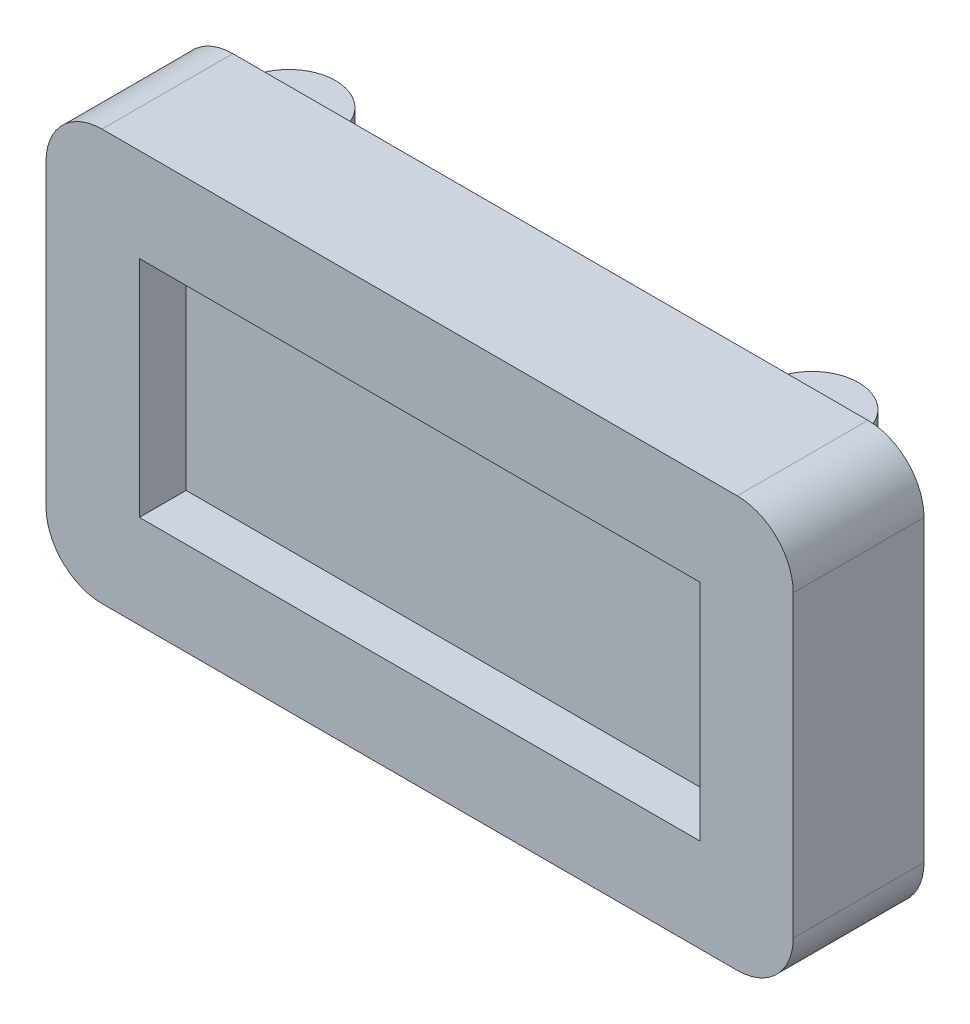
ISO-10303-21;
HEADER;
FILE_DESCRIPTION(('STEP AP214'),'2;1');
FILE_NAME('part.step','',(''),(''),'','','');
FILE_SCHEMA(('AUTOMOTIVE_DESIGN { 1 0 10303 214 1 1 1 1 }'));
ENDSEC;
DATA;
#1=APPLICATION_CONTEXT('core data for automotive mechanical design processes');
#2=APPLICATION_PROTOCOL_DEFINITION('international standard','automotive_design',2000,#1);
#3=PRODUCT_CONTEXT('',#1,'mechanical');
#4=PRODUCT('Part','Part','',(#3));
#5=PRODUCT_RELATED_PRODUCT_CATEGORY('part','',(#4));
#6=PRODUCT_DEFINITION_FORMATION('','',#4);
#7=PRODUCT_DEFINITION_CONTEXT('part definition',#1,'design');
#8=PRODUCT_DEFINITION('design','',#6,#7);
#9=PRODUCT_DEFINITION_SHAPE('','',#8);
#10=(LENGTH_UNIT() NAMED_UNIT(*) SI_UNIT(.MILLI.,.METRE.));
#11=(NAMED_UNIT(*) PLANE_ANGLE_UNIT() SI_UNIT($,.RADIAN.));
#12=(NAMED_UNIT(*) SI_UNIT($,.STERADIAN.) SOLID_ANGLE_UNIT());
#13=UNCERTAINTY_MEASURE_WITH_UNIT(LENGTH_MEASURE(1.E-05),#10,'distance_accuracy_value','');
#14=(GEOMETRIC_REPRESENTATION_CONTEXT(3) GLOBAL_UNCERTAINTY_ASSIGNED_CONTEXT((#13)) GLOBAL_UNIT_ASSIGNED_CONTEXT((#10,
#11,#12)) REPRESENTATION_CONTEXT('',''));
#15=CARTESIAN_POINT('',(0.,0.,0.));
#16=DIRECTION('',(0.,0.,1.));
#17=DIRECTION('',(1.,0.,0.));
#18=AXIS2_PLACEMENT_3D('',#15,#16,#17);
#19=CARTESIAN_POINT('',(0.,0.,0.));
#20=DIRECTION('',(0.,0.,-1.));
#21=DIRECTION('',(-1.,0.,0.));
#22=AXIS2_PLACEMENT_3D('',#19,#20,#21);
#23=PLANE('',#22);
#24=DIRECTION('',(0.,1.,0.));
#25=VECTOR('',#24,1.);
#26=CARTESIAN_POINT('',(40.,0.,0.));
#27=LINE('',#26,#25);
#28=CARTESIAN_POINT('',(40.,3.,0.));
#29=VERTEX_POINT('',#28);
#30=CARTESIAN_POINT('',(40.,19.,0.));
#31=VERTEX_POINT('',#30);
#32=EDGE_CURVE('E333',#29,#31,#27,.T.);
#33=ORIENTED_EDGE('',*,*,#32,.F.);
#34=CARTESIAN_POINT('',(37.,3.,0.));
#35=DIRECTION('',(0.,0.,-1.));
#36=DIRECTION('',(-1.,0.,0.));
#37=AXIS2_PLACEMENT_3D('',#34,#35,#36);
#38=CIRCLE('',#37,3.);
#39=CARTESIAN_POINT('',(37.,0.,0.));
#40=VERTEX_POINT('',#39);
#41=EDGE_CURVE('E355',#29,#40,#38,.T.);
#42=ORIENTED_EDGE('',*,*,#41,.T.);
#43=DIRECTION('',(1.,0.,0.));
#44=VECTOR('',#43,1.);
#45=CARTESIAN_POINT('',(0.,0.,0.));
#46=LINE('',#45,#44);
#47=CARTESIAN_POINT('',(3.,0.,0.));
#48=VERTEX_POINT('',#47);
#49=EDGE_CURVE('E329',#48,#40,#46,.T.);
#50=ORIENTED_EDGE('',*,*,#49,.F.);
#51=CARTESIAN_POINT('',(3.,3.,0.));
#52=DIRECTION('',(0.,0.,-1.));
#53=DIRECTION('',(-1.,0.,0.));
#54=AXIS2_PLACEMENT_3D('',#51,#52,#53);
#55=CIRCLE('',#54,3.);
#56=CARTESIAN_POINT('',(0.,3.,0.));
#57=VERTEX_POINT('',#56);
#58=EDGE_CURVE('E352',#48,#57,#55,.T.);
#59=ORIENTED_EDGE('',*,*,#58,.T.);
#60=DIRECTION('',(0.,-1.,0.));
#61=VECTOR('',#60,1.);
#62=CARTESIAN_POINT('',(0.,0.,0.));
#63=LINE('',#62,#61);
#64=CARTESIAN_POINT('',(0.,19.,0.));
#65=VERTEX_POINT('',#64);
#66=EDGE_CURVE('E298',#65,#57,#63,.T.);
#67=ORIENTED_EDGE('',*,*,#66,.F.);
#68=CARTESIAN_POINT('',(3.,19.,0.));
#69=DIRECTION('',(0.,0.,-1.));
#70=DIRECTION('',(-1.,0.,0.));
#71=AXIS2_PLACEMENT_3D('',#68,#69,#70);
#72=CIRCLE('',#71,3.);
#73=CARTESIAN_POINT('',(3.,22.,0.));
#74=VERTEX_POINT('',#73);
#75=EDGE_CURVE('E349',#65,#74,#72,.T.);
#76=ORIENTED_EDGE('',*,*,#75,.T.);
#77=DIRECTION('',(-1.,0.,0.));
#78=VECTOR('',#77,1.);
#79=CARTESIAN_POINT('',(0.,22.,0.));
#80=LINE('',#79,#78);
#81=CARTESIAN_POINT('',(37.,22.,0.));
#82=VERTEX_POINT('',#81);
#83=EDGE_CURVE('E313',#82,#74,#80,.T.);
#84=ORIENTED_EDGE('',*,*,#83,.F.);
#85=CARTESIAN_POINT('',(37.,19.,0.));
#86=DIRECTION('',(0.,0.,-1.));
#87=DIRECTION('',(-1.,0.,0.));
#88=AXIS2_PLACEMENT_3D('',#85,#86,#87);
#89=CIRCLE('',#88,3.);
#90=EDGE_CURVE('E346',#82,#31,#89,.T.);
#91=ORIENTED_EDGE('',*,*,#90,.T.);
#92=EDGE_LOOP('',(#33,#42,#50,#59,#67,#76,#84,#91));
#93=FACE_BOUND('',#92,.T.);
#94=DIRECTION('',(0.,1.,0.));
#95=VECTOR('',#94,1.);
#96=CARTESIAN_POINT('',(31.5,20.,0.));
#97=LINE('',#96,#95);
#98=CARTESIAN_POINT('',(31.5,20.,0.));
#99=VERTEX_POINT('',#98);
#100=CARTESIAN_POINT('',(31.5,21.,0.));
#101=VERTEX_POINT('',#100);
#102=EDGE_CURVE('E257',#99,#101,#97,.T.);
#103=ORIENTED_EDGE('',*,*,#102,.F.);
#104=DIRECTION('',(-1.,0.,0.));
#105=VECTOR('',#104,1.);
#106=CARTESIAN_POINT('',(0.,20.,0.));
#107=LINE('',#106,#105);
#108=CARTESIAN_POINT('',(36.5,20.,0.));
#109=VERTEX_POINT('',#108);
#110=EDGE_CURVE('E242',#109,#99,#107,.T.);
#111=ORIENTED_EDGE('',*,*,#110,.F.);
#112=DIRECTION('',(0.,1.,0.));
#113=VECTOR('',#112,1.);
#114=CARTESIAN_POINT('',(36.5,20.,0.));
#115=LINE('',#114,#113);
#116=CARTESIAN_POINT('',(36.5,21.,0.));
#117=VERTEX_POINT('',#116);
#118=EDGE_CURVE('E251',#109,#117,#115,.T.);
#119=ORIENTED_EDGE('',*,*,#118,.T.);
#120=DIRECTION('',(-1.,0.,0.));
#121=VECTOR('',#120,1.);
#122=CARTESIAN_POINT('',(0.,21.,0.));
#123=LINE('',#122,#121);
#124=EDGE_CURVE('E239',#117,#101,#123,.T.);
#125=ORIENTED_EDGE('',*,*,#124,.T.);
#126=EDGE_LOOP('',(#103,#111,#119,#125));
#127=FACE_BOUND('',#126,.T.);
#128=DIRECTION('',(0.,1.,0.));
#129=VECTOR('',#128,1.);
#130=CARTESIAN_POINT('',(3.5,20.,0.));
#131=LINE('',#130,#129);
#132=CARTESIAN_POINT('',(3.5,20.,0.));
#133=VERTEX_POINT('',#132);
#134=CARTESIAN_POINT('',(3.5,21.,0.));
#135=VERTEX_POINT('',#134);
#136=EDGE_CURVE('E235',#133,#135,#131,.T.);
#137=ORIENTED_EDGE('',*,*,#136,.F.);
#138=DIRECTION('',(-1.,0.,0.));
#139=VECTOR('',#138,1.);
#140=CARTESIAN_POINT('',(0.,20.,0.));
#141=LINE('',#140,#139);
#142=CARTESIAN_POINT('',(8.5,20.,0.));
#143=VERTEX_POINT('',#142);
#144=EDGE_CURVE('E220',#143,#133,#141,.T.);
#145=ORIENTED_EDGE('',*,*,#144,.F.);
#146=DIRECTION('',(0.,1.,0.));
#147=VECTOR('',#146,1.);
#148=CARTESIAN_POINT('',(8.5,20.,0.));
#149=LINE('',#148,#147);
#150=CARTESIAN_POINT('',(8.5,21.,0.));
#151=VERTEX_POINT('',#150);
#152=EDGE_CURVE('E229',#143,#151,#149,.T.);
#153=ORIENTED_EDGE('',*,*,#152,.T.);
#154=DIRECTION('',(-1.,0.,0.));
#155=VECTOR('',#154,1.);
#156=CARTESIAN_POINT('',(0.,21.,0.));
#157=LINE('',#156,#155);
#158=EDGE_CURVE('E217',#151,#135,#157,.T.);
#159=ORIENTED_EDGE('',*,*,#158,.T.);
#160=EDGE_LOOP('',(#137,#145,#153,#159));
#161=FACE_BOUND('',#160,.T.);
#162=DIRECTION('',(0.,-1.,0.));
#163=VECTOR('',#162,1.);
#164=CARTESIAN_POINT('',(36.5,2.,0.));
#165=LINE('',#164,#163);
#166=CARTESIAN_POINT('',(36.5,2.,0.));
#167=VERTEX_POINT('',#166);
#168=CARTESIAN_POINT('',(36.5,1.,0.));
#169=VERTEX_POINT('',#168);
#170=EDGE_CURVE('E213',#167,#169,#165,.T.);
#171=ORIENTED_EDGE('',*,*,#170,.F.);
#172=DIRECTION('',(-1.,0.,0.));
#173=VECTOR('',#172,1.);
#174=CARTESIAN_POINT('',(0.,2.,0.));
#175=LINE('',#174,#173);
#176=CARTESIAN_POINT('',(31.5,2.,0.));
#177=VERTEX_POINT('',#176);
#178=EDGE_CURVE('E198',#167,#177,#175,.T.);
#179=ORIENTED_EDGE('',*,*,#178,.T.);
#180=DIRECTION('',(0.,-1.,0.));
#181=VECTOR('',#180,1.);
#182=CARTESIAN_POINT('',(31.5,2.,0.));
#183=LINE('',#182,#181);
#184=CARTESIAN_POINT('',(31.5,1.,0.));
#185=VERTEX_POINT('',#184);
#186=EDGE_CURVE('E206',#177,#185,#183,.T.);
#187=ORIENTED_EDGE('',*,*,#186,.T.);
#188=DIRECTION('',(-1.,0.,0.));
#189=VECTOR('',#188,1.);
#190=CARTESIAN_POINT('',(0.,1.,0.));
#191=LINE('',#190,#189);
#192=EDGE_CURVE('E196',#169,#185,#191,.T.);
#193=ORIENTED_EDGE('',*,*,#192,.F.);
#194=EDGE_LOOP('',(#171,#179,#187,#193));
#195=FACE_BOUND('',#194,.T.);
#196=DIRECTION('',(0.,-1.,0.));
#197=VECTOR('',#196,1.);
#198=CARTESIAN_POINT('',(8.5,2.,0.));
#199=LINE('',#198,#197);
#200=CARTESIAN_POINT('',(8.5,2.,0.));
#201=VERTEX_POINT('',#200);
#202=CARTESIAN_POINT('',(8.5,1.,0.));
#203=VERTEX_POINT('',#202);
#204=EDGE_CURVE('E57',#201,#203,#199,.T.);
#205=ORIENTED_EDGE('',*,*,#204,.F.);
#206=DIRECTION('',(-1.,0.,0.));
#207=VECTOR('',#206,1.);
#208=CARTESIAN_POINT('',(0.,2.,0.));
#209=LINE('',#208,#207);
#210=CARTESIAN_POINT('',(3.5,2.,0.));
#211=VERTEX_POINT('',#210);
#212=EDGE_CURVE('E62',#201,#211,#209,.T.);
#213=ORIENTED_EDGE('',*,*,#212,.T.);
#214=DIRECTION('',(0.,-1.,0.));
#215=VECTOR('',#214,1.);
#216=CARTESIAN_POINT('',(3.5,2.,0.));
#217=LINE('',#216,#215);
#218=CARTESIAN_POINT('',(3.5,1.,0.));
#219=VERTEX_POINT('',#218);
#220=EDGE_CURVE('E175',#211,#219,#217,.T.);
#221=ORIENTED_EDGE('',*,*,#220,.T.);
#222=DIRECTION('',(-1.,0.,0.));
#223=VECTOR('',#222,1.);
#224=CARTESIAN_POINT('',(0.,1.,0.));
#225=LINE('',#224,#223);
#226=EDGE_CURVE('E178',#203,#219,#225,.T.);
#227=ORIENTED_EDGE('',*,*,#226,.F.);
#228=EDGE_LOOP('',(#205,#213,#221,#227));
#229=FACE_BOUND('',#228,.T.);
#230=ADVANCED_FACE('F41',(#93,#127,#161,#195,#229),#23,.T.);
#231=CARTESIAN_POINT('',(0.,0.,7.));
#232=DIRECTION('',(1.,0.,0.));
#233=DIRECTION('',(0.,0.,-1.));
#234=AXIS2_PLACEMENT_3D('',#231,#232,#233);
#235=PLANE('',#234);
#236=ORIENTED_EDGE('',*,*,#66,.T.);
#237=DIRECTION('',(0.,0.,-1.));
#238=VECTOR('',#237,1.);
#239=CARTESIAN_POINT('',(0.,3.,7.));
#240=LINE('',#239,#238);
#241=CARTESIAN_POINT('',(0.,3.,7.));
#242=VERTEX_POINT('',#241);
#243=EDGE_CURVE('E381',#57,#242,#240,.F.);
#244=ORIENTED_EDGE('',*,*,#243,.T.);
#245=DIRECTION('',(0.,-1.,0.));
#246=VECTOR('',#245,1.);
#247=CARTESIAN_POINT('',(0.,0.,7.));
#248=LINE('',#247,#246);
#249=CARTESIAN_POINT('',(0.,19.,7.));
#250=VERTEX_POINT('',#249);
#251=EDGE_CURVE('E308',#250,#242,#248,.T.);
#252=ORIENTED_EDGE('',*,*,#251,.F.);
#253=DIRECTION('',(0.,0.,-1.));
#254=VECTOR('',#253,1.);
#255=CARTESIAN_POINT('',(0.,19.,7.));
#256=LINE('',#255,#254);
#257=EDGE_CURVE('E377',#250,#65,#256,.T.);
#258=ORIENTED_EDGE('',*,*,#257,.T.);
#259=EDGE_LOOP('',(#236,#244,#252,#258));
#260=FACE_BOUND('',#259,.T.);
#261=ADVANCED_FACE('F403',(#260),#235,.F.);
#262=CARTESIAN_POINT('',(0.,0.,7.));
#263=DIRECTION('',(0.,1.,0.));
#264=DIRECTION('',(0.,0.,1.));
#265=AXIS2_PLACEMENT_3D('',#262,#263,#264);
#266=PLANE('',#265);
#267=ORIENTED_EDGE('',*,*,#49,.T.);
#268=DIRECTION('',(0.,0.,-1.));
#269=VECTOR('',#268,1.);
#270=CARTESIAN_POINT('',(37.,0.,7.));
#271=LINE('',#270,#269);
#272=CARTESIAN_POINT('',(37.,0.,7.));
#273=VERTEX_POINT('',#272);
#274=EDGE_CURVE('E362',#40,#273,#271,.F.);
#275=ORIENTED_EDGE('',*,*,#274,.T.);
#276=DIRECTION('',(1.,0.,0.));
#277=VECTOR('',#276,1.);
#278=CARTESIAN_POINT('',(0.,0.,7.));
#279=LINE('',#278,#277);
#280=CARTESIAN_POINT('',(3.,0.,7.));
#281=VERTEX_POINT('',#280);
#282=EDGE_CURVE('E312',#281,#273,#279,.T.);
#283=ORIENTED_EDGE('',*,*,#282,.F.);
#284=DIRECTION('',(0.,0.,-1.));
#285=VECTOR('',#284,1.);
#286=CARTESIAN_POINT('',(3.,0.,7.));
#287=LINE('',#286,#285);
#288=EDGE_CURVE('E358',#281,#48,#287,.T.);
#289=ORIENTED_EDGE('',*,*,#288,.T.);
#290=EDGE_LOOP('',(#267,#275,#283,#289));
#291=FACE_BOUND('',#290,.T.);
#292=ADVANCED_FACE('F414',(#291),#266,.F.);
#293=CARTESIAN_POINT('',(40.,0.,7.));
#294=DIRECTION('',(-1.,0.,0.));
#295=DIRECTION('',(0.,0.,1.));
#296=AXIS2_PLACEMENT_3D('',#293,#294,#295);
#297=PLANE('',#296);
#298=DIRECTION('',(0.,1.,0.));
#299=VECTOR('',#298,1.);
#300=CARTESIAN_POINT('',(40.,0.,7.));
#301=LINE('',#300,#299);
#302=CARTESIAN_POINT('',(40.,3.,7.));
#303=VERTEX_POINT('',#302);
#304=CARTESIAN_POINT('',(40.,19.,7.));
#305=VERTEX_POINT('',#304);
#306=EDGE_CURVE('E317',#303,#305,#301,.T.);
#307=ORIENTED_EDGE('',*,*,#306,.F.);
#308=DIRECTION('',(0.,0.,-1.));
#309=VECTOR('',#308,1.);
#310=CARTESIAN_POINT('',(40.,3.,7.));
#311=LINE('',#310,#309);
#312=EDGE_CURVE('E342',#303,#29,#311,.T.);
#313=ORIENTED_EDGE('',*,*,#312,.T.);
#314=ORIENTED_EDGE('',*,*,#32,.T.);
#315=DIRECTION('',(0.,0.,-1.));
#316=VECTOR('',#315,1.);
#317=CARTESIAN_POINT('',(40.,19.,7.));
#318=LINE('',#317,#316);
#319=EDGE_CURVE('E325',#31,#305,#318,.F.);
#320=ORIENTED_EDGE('',*,*,#319,.T.);
#321=EDGE_LOOP('',(#307,#313,#314,#320));
#322=FACE_BOUND('',#321,.T.);
#323=ADVANCED_FACE('F422',(#322),#297,.F.);
#324=CARTESIAN_POINT('',(0.,22.,7.));
#325=DIRECTION('',(0.,-1.,0.));
#326=DIRECTION('',(0.,0.,-1.));
#327=AXIS2_PLACEMENT_3D('',#324,#325,#326);
#328=PLANE('',#327);
#329=ORIENTED_EDGE('',*,*,#83,.T.);
#330=DIRECTION('',(0.,0.,-1.));
#331=VECTOR('',#330,1.);
#332=CARTESIAN_POINT('',(3.,22.,7.));
#333=LINE('',#332,#331);
#334=CARTESIAN_POINT('',(3.,22.,7.));
#335=VERTEX_POINT('',#334);
#336=EDGE_CURVE('E11',#74,#335,#333,.F.);
#337=ORIENTED_EDGE('',*,*,#336,.T.);
#338=DIRECTION('',(-1.,0.,0.));
#339=VECTOR('',#338,1.);
#340=CARTESIAN_POINT('',(0.,22.,7.));
#341=LINE('',#340,#339);
#342=CARTESIAN_POINT('',(37.,22.,7.));
#343=VERTEX_POINT('',#342);
#344=EDGE_CURVE('E321',#343,#335,#341,.T.);
#345=ORIENTED_EDGE('',*,*,#344,.F.);
#346=DIRECTION('',(0.,0.,-1.));
#347=VECTOR('',#346,1.);
#348=CARTESIAN_POINT('',(37.,22.,7.));
#349=LINE('',#348,#347);
#350=EDGE_CURVE('E50',#343,#82,#349,.T.);
#351=ORIENTED_EDGE('',*,*,#350,.T.);
#352=EDGE_LOOP('',(#329,#337,#345,#351));
#353=FACE_BOUND('',#352,.T.);
#354=ADVANCED_FACE('F389',(#353),#328,.F.);
#355=CARTESIAN_POINT('',(0.,0.,7.));
#356=DIRECTION('',(0.,0.,-1.));
#357=DIRECTION('',(-1.,0.,0.));
#358=AXIS2_PLACEMENT_3D('',#355,#356,#357);
#359=PLANE('',#358);
#360=DIRECTION('',(1.,0.,0.));
#361=VECTOR('',#360,1.);
#362=CARTESIAN_POINT('',(5.,5.,7.));
#363=LINE('',#362,#361);
#364=CARTESIAN_POINT('',(5.,5.,7.));
#365=VERTEX_POINT('',#364);
#366=CARTESIAN_POINT('',(35.,5.,7.));
#367=VERTEX_POINT('',#366);
#368=EDGE_CURVE('E284',#365,#367,#363,.T.);
#369=ORIENTED_EDGE('',*,*,#368,.F.);
#370=DIRECTION('',(0.,-1.,0.));
#371=VECTOR('',#370,1.);
#372=CARTESIAN_POINT('',(5.,17.,7.));
#373=LINE('',#372,#371);
#374=CARTESIAN_POINT('',(5.,17.,7.));
#375=VERTEX_POINT('',#374);
#376=EDGE_CURVE('E261',#375,#365,#373,.T.);
#377=ORIENTED_EDGE('',*,*,#376,.F.);
#378=DIRECTION('',(-1.,0.,0.));
#379=VECTOR('',#378,1.);
#380=CARTESIAN_POINT('',(35.,17.,7.));
#381=LINE('',#380,#379);
#382=CARTESIAN_POINT('',(35.,17.,7.));
#383=VERTEX_POINT('',#382);
#384=EDGE_CURVE('E269',#383,#375,#381,.T.);
#385=ORIENTED_EDGE('',*,*,#384,.F.);
#386=DIRECTION('',(0.,1.,0.));
#387=VECTOR('',#386,1.);
#388=CARTESIAN_POINT('',(35.,5.,7.));
#389=LINE('',#388,#387);
#390=EDGE_CURVE('E288',#367,#383,#389,.T.);
#391=ORIENTED_EDGE('',*,*,#390,.F.);
#392=EDGE_LOOP('',(#369,#377,#385,#391));
#393=FACE_BOUND('',#392,.T.);
#394=ORIENTED_EDGE('',*,*,#282,.T.);
#395=CARTESIAN_POINT('',(37.,3.,7.));
#396=DIRECTION('',(0.,0.,-1.));
#397=DIRECTION('',(-1.,0.,0.));
#398=AXIS2_PLACEMENT_3D('',#395,#396,#397);
#399=CIRCLE('',#398,3.);
#400=EDGE_CURVE('E374',#273,#303,#399,.F.);
#401=ORIENTED_EDGE('',*,*,#400,.T.);
#402=ORIENTED_EDGE('',*,*,#306,.T.);
#403=CARTESIAN_POINT('',(37.,19.,7.));
#404=DIRECTION('',(0.,0.,-1.));
#405=DIRECTION('',(-1.,0.,0.));
#406=AXIS2_PLACEMENT_3D('',#403,#404,#405);
#407=CIRCLE('',#406,3.);
#408=EDGE_CURVE('E365',#305,#343,#407,.F.);
#409=ORIENTED_EDGE('',*,*,#408,.T.);
#410=ORIENTED_EDGE('',*,*,#344,.T.);
#411=CARTESIAN_POINT('',(3.,19.,7.));
#412=DIRECTION('',(0.,0.,-1.));
#413=DIRECTION('',(-1.,0.,0.));
#414=AXIS2_PLACEMENT_3D('',#411,#412,#413);
#415=CIRCLE('',#414,3.);
#416=EDGE_CURVE('E368',#335,#250,#415,.F.);
#417=ORIENTED_EDGE('',*,*,#416,.T.);
#418=ORIENTED_EDGE('',*,*,#251,.T.);
#419=CARTESIAN_POINT('',(3.,3.,7.));
#420=DIRECTION('',(0.,0.,-1.));
#421=DIRECTION('',(-1.,0.,0.));
#422=AXIS2_PLACEMENT_3D('',#419,#420,#421);
#423=CIRCLE('',#422,3.);
#424=EDGE_CURVE('E371',#242,#281,#423,.F.);
#425=ORIENTED_EDGE('',*,*,#424,.T.);
#426=EDGE_LOOP('',(#394,#401,#402,#409,#410,#417,#418,#425));
#427=FACE_BOUND('',#426,.T.);
#428=ADVANCED_FACE('F407',(#393,#427),#359,.F.);
#429=CARTESIAN_POINT('',(37.,3.,7.));
#430=DIRECTION('',(0.,0.,-1.));
#431=DIRECTION('',(-1.,0.,0.));
#432=AXIS2_PLACEMENT_3D('',#429,#430,#431);
#433=CYLINDRICAL_SURFACE('',#432,3.);
#434=ORIENTED_EDGE('',*,*,#400,.F.);
#435=ORIENTED_EDGE('',*,*,#274,.F.);
#436=ORIENTED_EDGE('',*,*,#41,.F.);
#437=ORIENTED_EDGE('',*,*,#312,.F.);
#438=EDGE_LOOP('',(#434,#435,#436,#437));
#439=FACE_BOUND('',#438,.T.);
#440=ADVANCED_FACE('F419',(#439),#433,.T.);
#441=CARTESIAN_POINT('',(3.,3.,7.));
#442=DIRECTION('',(0.,0.,-1.));
#443=DIRECTION('',(-1.,0.,0.));
#444=AXIS2_PLACEMENT_3D('',#441,#442,#443);
#445=CYLINDRICAL_SURFACE('',#444,3.);
#446=ORIENTED_EDGE('',*,*,#424,.F.);
#447=ORIENTED_EDGE('',*,*,#243,.F.);
#448=ORIENTED_EDGE('',*,*,#58,.F.);
#449=ORIENTED_EDGE('',*,*,#288,.F.);
#450=EDGE_LOOP('',(#446,#447,#448,#449));
#451=FACE_BOUND('',#450,.T.);
#452=ADVANCED_FACE('F411',(#451),#445,.T.);
#453=CARTESIAN_POINT('',(3.,19.,7.));
#454=DIRECTION('',(0.,0.,-1.));
#455=DIRECTION('',(-1.,0.,0.));
#456=AXIS2_PLACEMENT_3D('',#453,#454,#455);
#457=CYLINDRICAL_SURFACE('',#456,3.);
#458=ORIENTED_EDGE('',*,*,#416,.F.);
#459=ORIENTED_EDGE('',*,*,#336,.F.);
#460=ORIENTED_EDGE('',*,*,#75,.F.);
#461=ORIENTED_EDGE('',*,*,#257,.F.);
#462=EDGE_LOOP('',(#458,#459,#460,#461));
#463=FACE_BOUND('',#462,.T.);
#464=ADVANCED_FACE('F400',(#463),#457,.T.);
#465=CARTESIAN_POINT('',(37.,19.,7.));
#466=DIRECTION('',(0.,0.,-1.));
#467=DIRECTION('',(-1.,0.,0.));
#468=AXIS2_PLACEMENT_3D('',#465,#466,#467);
#469=CYLINDRICAL_SURFACE('',#468,3.);
#470=ORIENTED_EDGE('',*,*,#408,.F.);
#471=ORIENTED_EDGE('',*,*,#319,.F.);
#472=ORIENTED_EDGE('',*,*,#90,.F.);
#473=ORIENTED_EDGE('',*,*,#350,.F.);
#474=EDGE_LOOP('',(#470,#471,#472,#473));
#475=FACE_BOUND('',#474,.T.);
#476=ADVANCED_FACE('F43',(#475),#469,.T.);
#477=CARTESIAN_POINT('',(5.,17.,4.5));
#478=DIRECTION('',(-1.,0.,0.));
#479=DIRECTION('',(0.,0.,1.));
#480=AXIS2_PLACEMENT_3D('',#477,#478,#479);
#481=PLANE('',#480);
#482=ORIENTED_EDGE('',*,*,#376,.T.);
#483=DIRECTION('',(0.,0.,1.));
#484=VECTOR('',#483,1.);
#485=CARTESIAN_POINT('',(5.,5.,4.5));
#486=LINE('',#485,#484);
#487=CARTESIAN_POINT('',(5.,5.,4.5));
#488=VERTEX_POINT('',#487);
#489=EDGE_CURVE('E281',#488,#365,#486,.T.);
#490=ORIENTED_EDGE('',*,*,#489,.F.);
#491=DIRECTION('',(0.,-1.,0.));
#492=VECTOR('',#491,1.);
#493=CARTESIAN_POINT('',(5.,17.,4.5));
#494=LINE('',#493,#492);
#495=CARTESIAN_POINT('',(5.,17.,4.5));
#496=VERTEX_POINT('',#495);
#497=EDGE_CURVE('E264',#496,#488,#494,.T.);
#498=ORIENTED_EDGE('',*,*,#497,.F.);
#499=DIRECTION('',(0.,0.,1.));
#500=VECTOR('',#499,1.);
#501=CARTESIAN_POINT('',(5.,17.,4.5));
#502=LINE('',#501,#500);
#503=EDGE_CURVE('E295',#496,#375,#502,.T.);
#504=ORIENTED_EDGE('',*,*,#503,.T.);
#505=EDGE_LOOP('',(#482,#490,#498,#504));
#506=FACE_BOUND('',#505,.T.);
#507=ADVANCED_FACE('F425',(#506),#481,.F.);
#508=CARTESIAN_POINT('',(35.,17.,4.5));
#509=DIRECTION('',(0.,1.,0.));
#510=DIRECTION('',(0.,0.,1.));
#511=AXIS2_PLACEMENT_3D('',#508,#509,#510);
#512=PLANE('',#511);
#513=ORIENTED_EDGE('',*,*,#384,.T.);
#514=ORIENTED_EDGE('',*,*,#503,.F.);
#515=DIRECTION('',(-1.,0.,0.));
#516=VECTOR('',#515,1.);
#517=CARTESIAN_POINT('',(35.,17.,4.5));
#518=LINE('',#517,#516);
#519=CARTESIAN_POINT('',(35.,17.,4.5));
#520=VERTEX_POINT('',#519);
#521=EDGE_CURVE('E277',#520,#496,#518,.T.);
#522=ORIENTED_EDGE('',*,*,#521,.F.);
#523=DIRECTION('',(0.,0.,1.));
#524=VECTOR('',#523,1.);
#525=CARTESIAN_POINT('',(35.,17.,4.5));
#526=LINE('',#525,#524);
#527=EDGE_CURVE('E299',#520,#383,#526,.T.);
#528=ORIENTED_EDGE('',*,*,#527,.T.);
#529=EDGE_LOOP('',(#513,#514,#522,#528));
#530=FACE_BOUND('',#529,.T.);
#531=ADVANCED_FACE('F430',(#530),#512,.F.);
#532=CARTESIAN_POINT('',(35.,5.,4.5));
#533=DIRECTION('',(1.,0.,0.));
#534=DIRECTION('',(0.,0.,-1.));
#535=AXIS2_PLACEMENT_3D('',#532,#533,#534);
#536=PLANE('',#535);
#537=ORIENTED_EDGE('',*,*,#390,.T.);
#538=ORIENTED_EDGE('',*,*,#527,.F.);
#539=DIRECTION('',(0.,1.,0.));
#540=VECTOR('',#539,1.);
#541=CARTESIAN_POINT('',(35.,5.,4.5));
#542=LINE('',#541,#540);
#543=CARTESIAN_POINT('',(35.,5.,4.5));
#544=VERTEX_POINT('',#543);
#545=EDGE_CURVE('E273',#544,#520,#542,.T.);
#546=ORIENTED_EDGE('',*,*,#545,.F.);
#547=DIRECTION('',(0.,0.,1.));
#548=VECTOR('',#547,1.);
#549=CARTESIAN_POINT('',(35.,5.,4.5));
#550=LINE('',#549,#548);
#551=EDGE_CURVE('E302',#544,#367,#550,.T.);
#552=ORIENTED_EDGE('',*,*,#551,.T.);
#553=EDGE_LOOP('',(#537,#538,#546,#552));
#554=FACE_BOUND('',#553,.T.);
#555=ADVANCED_FACE('F487',(#554),#536,.F.);
#556=CARTESIAN_POINT('',(5.,5.,4.5));
#557=DIRECTION('',(0.,-1.,0.));
#558=DIRECTION('',(0.,0.,-1.));
#559=AXIS2_PLACEMENT_3D('',#556,#557,#558);
#560=PLANE('',#559);
#561=ORIENTED_EDGE('',*,*,#368,.T.);
#562=ORIENTED_EDGE('',*,*,#551,.F.);
#563=DIRECTION('',(1.,0.,0.));
#564=VECTOR('',#563,1.);
#565=CARTESIAN_POINT('',(5.,5.,4.5));
#566=LINE('',#565,#564);
#567=EDGE_CURVE('E268',#488,#544,#566,.T.);
#568=ORIENTED_EDGE('',*,*,#567,.F.);
#569=ORIENTED_EDGE('',*,*,#489,.T.);
#570=EDGE_LOOP('',(#561,#562,#568,#569));
#571=FACE_BOUND('',#570,.T.);
#572=ADVANCED_FACE('F497',(#571),#560,.F.);
#573=CARTESIAN_POINT('',(0.,0.,4.5));
#574=DIRECTION('',(0.,0.,1.));
#575=DIRECTION('',(1.,0.,0.));
#576=AXIS2_PLACEMENT_3D('',#573,#574,#575);
#577=PLANE('',#576);
#578=ORIENTED_EDGE('',*,*,#497,.T.);
#579=ORIENTED_EDGE('',*,*,#567,.T.);
#580=ORIENTED_EDGE('',*,*,#545,.T.);
#581=ORIENTED_EDGE('',*,*,#521,.T.);
#582=EDGE_LOOP('',(#578,#579,#580,#581));
#583=FACE_BOUND('',#582,.T.);
#584=ADVANCED_FACE('F507',(#583),#577,.T.);
#585=CARTESIAN_POINT('',(34.,20.,0.));
#586=DIRECTION('',(0.,1.,0.));
#587=DIRECTION('',(0.,0.,1.));
#588=AXIS2_PLACEMENT_3D('',#585,#586,#587);
#589=CYLINDRICAL_SURFACE('',#588,2.49999999999999);
#590=CARTESIAN_POINT('',(34.,21.,0.));
#591=DIRECTION('',(0.,1.,0.));
#592=DIRECTION('',(0.,0.,1.));
#593=AXIS2_PLACEMENT_3D('',#590,#591,#592);
#594=CIRCLE('',#593,2.49999999999999);
#595=EDGE_CURVE('E247',#117,#101,#594,.T.);
#596=ORIENTED_EDGE('',*,*,#595,.F.);
#597=ORIENTED_EDGE('',*,*,#118,.F.);
#598=CARTESIAN_POINT('',(34.,20.,0.));
#599=DIRECTION('',(0.,1.,0.));
#600=DIRECTION('',(0.,0.,1.));
#601=AXIS2_PLACEMENT_3D('',#598,#599,#600);
#602=CIRCLE('',#601,2.49999999999999);
#603=EDGE_CURVE('E246',#109,#99,#602,.T.);
#604=ORIENTED_EDGE('',*,*,#603,.T.);
#605=ORIENTED_EDGE('',*,*,#102,.T.);
#606=EDGE_LOOP('',(#596,#597,#604,#605));
#607=FACE_BOUND('',#606,.T.);
#608=ADVANCED_FACE('F517',(#607),#589,.T.);
#609=CARTESIAN_POINT('',(0.,20.,0.));
#610=DIRECTION('',(0.,1.,0.));
#611=DIRECTION('',(0.,0.,1.));
#612=AXIS2_PLACEMENT_3D('',#609,#610,#611);
#613=PLANE('',#612);
#614=ORIENTED_EDGE('',*,*,#110,.T.);
#615=ORIENTED_EDGE('',*,*,#603,.F.);
#616=EDGE_LOOP('',(#614,#615));
#617=FACE_BOUND('',#616,.T.);
#618=ADVANCED_FACE('F528',(#617),#613,.F.);
#619=CARTESIAN_POINT('',(0.,21.,0.));
#620=DIRECTION('',(0.,1.,0.));
#621=DIRECTION('',(0.,0.,1.));
#622=AXIS2_PLACEMENT_3D('',#619,#620,#621);
#623=PLANE('',#622);
#624=ORIENTED_EDGE('',*,*,#124,.F.);
#625=ORIENTED_EDGE('',*,*,#595,.T.);
#626=EDGE_LOOP('',(#624,#625));
#627=FACE_BOUND('',#626,.T.);
#628=ADVANCED_FACE('F540',(#627),#623,.T.);
#629=CARTESIAN_POINT('',(6.,20.,0.));
#630=DIRECTION('',(0.,1.,0.));
#631=DIRECTION('',(0.,0.,1.));
#632=AXIS2_PLACEMENT_3D('',#629,#630,#631);
#633=CYLINDRICAL_SURFACE('',#632,2.5);
#634=CARTESIAN_POINT('',(6.,21.,0.));
#635=DIRECTION('',(0.,1.,0.));
#636=DIRECTION('',(0.,0.,1.));
#637=AXIS2_PLACEMENT_3D('',#634,#635,#636);
#638=CIRCLE('',#637,2.5);
#639=EDGE_CURVE('E225',#151,#135,#638,.T.);
#640=ORIENTED_EDGE('',*,*,#639,.F.);
#641=ORIENTED_EDGE('',*,*,#152,.F.);
#642=CARTESIAN_POINT('',(6.,20.,0.));
#643=DIRECTION('',(0.,1.,0.));
#644=DIRECTION('',(0.,0.,1.));
#645=AXIS2_PLACEMENT_3D('',#642,#643,#644);
#646=CIRCLE('',#645,2.5);
#647=EDGE_CURVE('E224',#143,#133,#646,.T.);
#648=ORIENTED_EDGE('',*,*,#647,.T.);
#649=ORIENTED_EDGE('',*,*,#136,.T.);
#650=EDGE_LOOP('',(#640,#641,#648,#649));
#651=FACE_BOUND('',#650,.T.);
#652=ADVANCED_FACE('F551',(#651),#633,.T.);
#653=CARTESIAN_POINT('',(0.,20.,0.));
#654=DIRECTION('',(0.,1.,0.));
#655=DIRECTION('',(0.,0.,1.));
#656=AXIS2_PLACEMENT_3D('',#653,#654,#655);
#657=PLANE('',#656);
#658=ORIENTED_EDGE('',*,*,#144,.T.);
#659=ORIENTED_EDGE('',*,*,#647,.F.);
#660=EDGE_LOOP('',(#658,#659));
#661=FACE_BOUND('',#660,.T.);
#662=ADVANCED_FACE('F562',(#661),#657,.F.);
#663=CARTESIAN_POINT('',(0.,21.,0.));
#664=DIRECTION('',(0.,1.,0.));
#665=DIRECTION('',(0.,0.,1.));
#666=AXIS2_PLACEMENT_3D('',#663,#664,#665);
#667=PLANE('',#666);
#668=ORIENTED_EDGE('',*,*,#158,.F.);
#669=ORIENTED_EDGE('',*,*,#639,.T.);
#670=EDGE_LOOP('',(#668,#669));
#671=FACE_BOUND('',#670,.T.);
#672=ADVANCED_FACE('F573',(#671),#667,.T.);
#673=CARTESIAN_POINT('',(34.,2.,0.));
#674=DIRECTION('',(0.,-1.,0.));
#675=DIRECTION('',(0.,0.,-1.));
#676=AXIS2_PLACEMENT_3D('',#673,#674,#675);
#677=CYLINDRICAL_SURFACE('',#676,2.49999999999999);
#678=CARTESIAN_POINT('',(34.,1.,0.));
#679=DIRECTION('',(0.,1.,0.));
#680=DIRECTION('',(0.,0.,1.));
#681=AXIS2_PLACEMENT_3D('',#678,#679,#680);
#682=CIRCLE('',#681,2.49999999999999);
#683=EDGE_CURVE('E202',#169,#185,#682,.T.);
#684=ORIENTED_EDGE('',*,*,#683,.T.);
#685=ORIENTED_EDGE('',*,*,#186,.F.);
#686=CARTESIAN_POINT('',(34.,2.,0.));
#687=DIRECTION('',(0.,1.,0.));
#688=DIRECTION('',(0.,0.,1.));
#689=AXIS2_PLACEMENT_3D('',#686,#687,#688);
#690=CIRCLE('',#689,2.49999999999999);
#691=EDGE_CURVE('E201',#167,#177,#690,.T.);
#692=ORIENTED_EDGE('',*,*,#691,.F.);
#693=ORIENTED_EDGE('',*,*,#170,.T.);
#694=EDGE_LOOP('',(#684,#685,#692,#693));
#695=FACE_BOUND('',#694,.T.);
#696=ADVANCED_FACE('F582',(#695),#677,.T.);
#697=CARTESIAN_POINT('',(0.,2.,0.));
#698=DIRECTION('',(0.,-1.,0.));
#699=DIRECTION('',(0.,0.,1.));
#700=AXIS2_PLACEMENT_3D('',#697,#698,#699);
#701=PLANE('',#700);
#702=ORIENTED_EDGE('',*,*,#178,.F.);
#703=ORIENTED_EDGE('',*,*,#691,.T.);
#704=EDGE_LOOP('',(#702,#703));
#705=FACE_BOUND('',#704,.T.);
#706=ADVANCED_FACE('F599',(#705),#701,.F.);
#707=CARTESIAN_POINT('',(0.,1.,0.));
#708=DIRECTION('',(0.,-1.,0.));
#709=DIRECTION('',(0.,0.,1.));
#710=AXIS2_PLACEMENT_3D('',#707,#708,#709);
#711=PLANE('',#710);
#712=ORIENTED_EDGE('',*,*,#192,.T.);
#713=ORIENTED_EDGE('',*,*,#683,.F.);
#714=EDGE_LOOP('',(#712,#713));
#715=FACE_BOUND('',#714,.T.);
#716=ADVANCED_FACE('F610',(#715),#711,.T.);
#717=CARTESIAN_POINT('',(6.,2.,0.));
#718=DIRECTION('',(0.,-1.,0.));
#719=DIRECTION('',(0.,0.,-1.));
#720=AXIS2_PLACEMENT_3D('',#717,#718,#719);
#721=CYLINDRICAL_SURFACE('',#720,2.5);
#722=CARTESIAN_POINT('',(6.,1.,0.));
#723=DIRECTION('',(0.,1.,0.));
#724=DIRECTION('',(0.,0.,1.));
#725=AXIS2_PLACEMENT_3D('',#722,#723,#724);
#726=CIRCLE('',#725,2.5);
#727=EDGE_CURVE('E184',#203,#219,#726,.T.);
#728=ORIENTED_EDGE('',*,*,#727,.T.);
#729=ORIENTED_EDGE('',*,*,#220,.F.);
#730=CARTESIAN_POINT('',(6.,2.,0.));
#731=DIRECTION('',(0.,1.,0.));
#732=DIRECTION('',(0.,0.,1.));
#733=AXIS2_PLACEMENT_3D('',#730,#731,#732);
#734=CIRCLE('',#733,2.5);
#735=EDGE_CURVE('E181',#201,#211,#734,.T.);
#736=ORIENTED_EDGE('',*,*,#735,.F.);
#737=ORIENTED_EDGE('',*,*,#204,.T.);
#738=EDGE_LOOP('',(#728,#729,#736,#737));
#739=FACE_BOUND('',#738,.T.);
#740=ADVANCED_FACE('F185',(#739),#721,.T.);
#741=CARTESIAN_POINT('',(0.,2.,0.));
#742=DIRECTION('',(0.,-1.,0.));
#743=DIRECTION('',(0.,0.,1.));
#744=AXIS2_PLACEMENT_3D('',#741,#742,#743);
#745=PLANE('',#744);
#746=ORIENTED_EDGE('',*,*,#212,.F.);
#747=ORIENTED_EDGE('',*,*,#735,.T.);
#748=EDGE_LOOP('',(#746,#747));
#749=FACE_BOUND('',#748,.T.);
#750=ADVANCED_FACE('F631',(#749),#745,.F.);
#751=CARTESIAN_POINT('',(0.,1.,0.));
#752=DIRECTION('',(0.,-1.,0.));
#753=DIRECTION('',(0.,0.,1.));
#754=AXIS2_PLACEMENT_3D('',#751,#752,#753);
#755=PLANE('',#754);
#756=ORIENTED_EDGE('',*,*,#226,.T.);
#757=ORIENTED_EDGE('',*,*,#727,.F.);
#758=EDGE_LOOP('',(#756,#757));
#759=FACE_BOUND('',#758,.T.);
#760=ADVANCED_FACE('F189',(#759),#755,.T.);
#761=CLOSED_SHELL('',(#230,#261,#292,#323,#354,#428,#440,#452,#464,#476,#507,#531,#555,#572,
#584,#608,#618,#628,#652,#662,#672,#696,#706,#716,#740,#750,#760));
#762=MANIFOLD_SOLID_BREP('B2',#761);
#763=ADVANCED_BREP_SHAPE_REPRESENTATION('',(#18,#762),#14);
#764=SHAPE_DEFINITION_REPRESENTATION(#9,#763);
ENDSEC;
END-ISO-10303-21;
